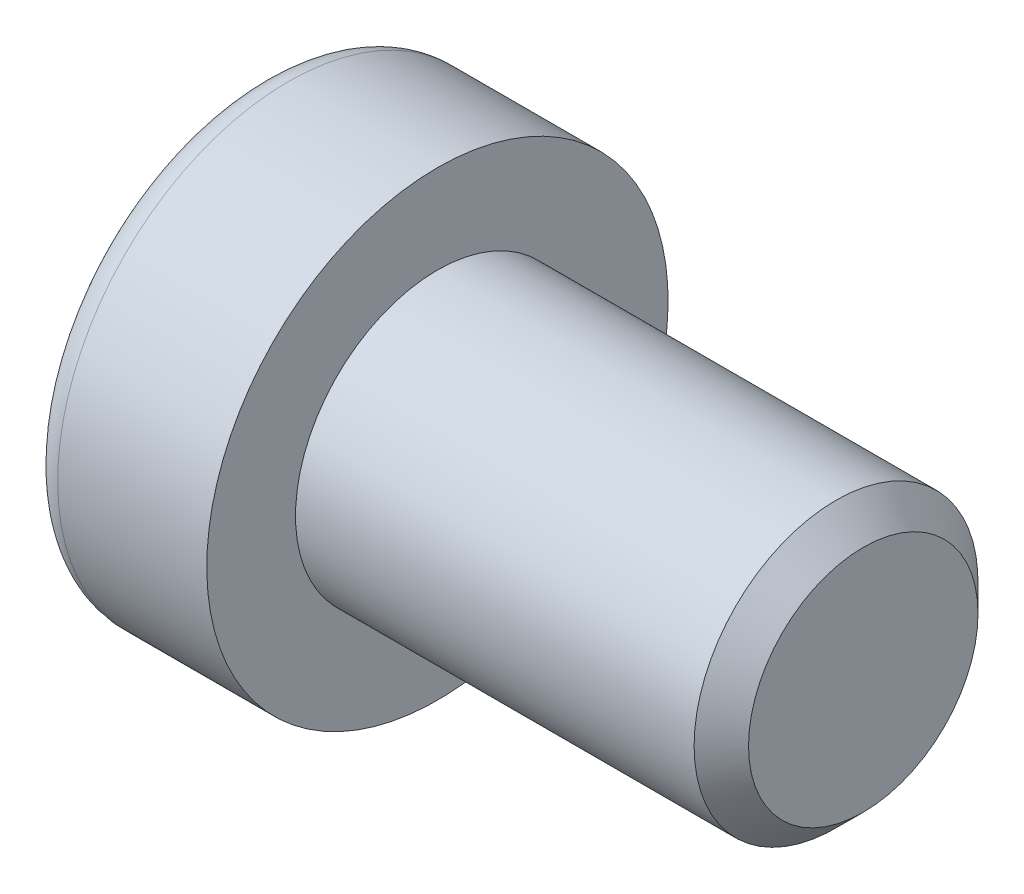
ISO-10303-21;
HEADER;
FILE_DESCRIPTION(('STEP AP214'),'2;1');
FILE_NAME('part.step','',(''),(''),'','','');
FILE_SCHEMA(('AUTOMOTIVE_DESIGN { 1 0 10303 214 1 1 1 1 }'));
ENDSEC;
DATA;
#1=APPLICATION_CONTEXT('core data for automotive mechanical design processes');
#2=APPLICATION_PROTOCOL_DEFINITION('international standard','automotive_design',2000,#1);
#3=PRODUCT_CONTEXT('',#1,'mechanical');
#4=PRODUCT('Part','Part','',(#3));
#5=PRODUCT_RELATED_PRODUCT_CATEGORY('part','',(#4));
#6=PRODUCT_DEFINITION_FORMATION('','',#4);
#7=PRODUCT_DEFINITION_CONTEXT('part definition',#1,'design');
#8=PRODUCT_DEFINITION('design','',#6,#7);
#9=PRODUCT_DEFINITION_SHAPE('','',#8);
#10=(LENGTH_UNIT() NAMED_UNIT(*) SI_UNIT(.MILLI.,.METRE.));
#11=(NAMED_UNIT(*) PLANE_ANGLE_UNIT() SI_UNIT($,.RADIAN.));
#12=(NAMED_UNIT(*) SI_UNIT($,.STERADIAN.) SOLID_ANGLE_UNIT());
#13=UNCERTAINTY_MEASURE_WITH_UNIT(LENGTH_MEASURE(1.E-05),#10,'distance_accuracy_value','');
#14=(GEOMETRIC_REPRESENTATION_CONTEXT(3) GLOBAL_UNCERTAINTY_ASSIGNED_CONTEXT((#13)) GLOBAL_UNIT_ASSIGNED_CONTEXT((#10,
#11,#12)) REPRESENTATION_CONTEXT('',''));
#15=CARTESIAN_POINT('',(0.,0.,0.));
#16=DIRECTION('',(0.,0.,1.));
#17=DIRECTION('',(1.,0.,0.));
#18=AXIS2_PLACEMENT_3D('',#15,#16,#17);
#19=CARTESIAN_POINT('',(-1.21000000177673,0.,0.));
#20=DIRECTION('',(-1.,0.,0.));
#21=DIRECTION('',(0.,0.,1.));
#22=AXIS2_PLACEMENT_3D('',#19,#20,#21);
#23=CONICAL_SURFACE('',#22,2.9040718530382,1.04719754996794);
#24=CARTESIAN_POINT('',(0.466666669012739,-1.13686837721616E-10,0.));
#25=VERTEX_POINT('',#24);
#26=VERTEX_LOOP('',#25);
#27=FACE_BOUND('',#26,.T.);
#28=CARTESIAN_POINT('',(-1.20000000188032,2.50000000042828,1.44337567243126));
#29=CARTESIAN_POINT('',(-1.16336943336427,2.50000000015382,1.31652043353318));
#30=CARTESIAN_POINT('',(-1.13005584831707,2.50000000004123,1.18857018203745));
#31=CARTESIAN_POINT('',(-1.07190798610144,2.49999999995868,0.930454306037677));
#32=CARTESIAN_POINT('',(-1.04709427719735,2.49999999998906,0.800284096806924));
#33=CARTESIAN_POINT('',(-1.00846995036617,2.50000000001067,0.541556812494233));
#34=CARTESIAN_POINT('',(-0.994402236162447,2.50000000000284,0.413039534770439));
#35=CARTESIAN_POINT('',(-0.977611461824864,2.49999999999716,0.155400578562858));
#36=CARTESIAN_POINT('',(-0.974874494142074,2.49999999999929,0.02627983588409));
#37=CARTESIAN_POINT('',(-0.980582864422355,2.50000000000062,-0.21496841995549));
#38=CARTESIAN_POINT('',(-0.987626608278002,2.50000000000017,-0.327132134383147));
#39=CARTESIAN_POINT('',(-1.00994662771906,2.49999999999983,-0.550728853222557));
#40=CARTESIAN_POINT('',(-1.02523052031715,2.49999999999995,-0.66216108485018));
#41=CARTESIAN_POINT('',(-1.06343729360609,2.50000000000005,-0.886218434015897));
#42=CARTESIAN_POINT('',(-1.08652205474861,2.50000000000003,-0.998815208377871));
#43=CARTESIAN_POINT('',(-1.13891470311393,2.49999999999998,-1.2223298619213));
#44=CARTESIAN_POINT('',(-1.16821028805135,2.49999999999995,-1.33325060237494));
#45=CARTESIAN_POINT('',(-1.20000000215881,2.5,-1.44337567242466));
#46=B_SPLINE_CURVE_WITH_KNOTS('',3,(#28,#29,#30,#31,#32,#33,#34,#35,#36,#37,#38,#39,#40,#41,#42,
#43,#44,#45),.UNSPECIFIED.,.F.,.F.,(4,2,2,2,2,2,2,2,4),(0.,0.396270014515872,0.793492271437725,
1.18088450788727,1.56780111135406,1.90463472821334,2.24178024186127,2.58640202744164,
2.93034746593166),.UNSPECIFIED.);
#47=CARTESIAN_POINT('',(-1.20000000213914,2.49999999973261,1.44337567281968));
#48=VERTEX_POINT('',#47);
#49=CARTESIAN_POINT('',(-1.20000000222827,2.5,-1.44337567266531));
#50=VERTEX_POINT('',#49);
#51=EDGE_CURVE('E18',#48,#50,#46,.T.);
#52=ORIENTED_EDGE('',*,*,#51,.T.);
#53=CARTESIAN_POINT('',(-1.20000000188032,2.49999999974406,-1.44337567361636));
#54=CARTESIAN_POINT('',(-1.16336943336427,2.39014014011794,-1.50680329282772));
#55=CARTESIAN_POINT('',(-1.13005584831707,2.27933197184574,-1.57077841847808));
#56=CARTESIAN_POINT('',(-1.07190798610144,2.05579706606859,-1.69983635640647));
#57=CARTESIAN_POINT('',(-1.04709427719735,1.94306635807401,-1.76492146104816));
#58=CARTESIAN_POINT('',(-1.00846995036617,1.71900195721787,-1.89428510322322));
#59=CARTESIAN_POINT('',(-0.994402236162447,1.60770272987993,-1.95854374207834));
#60=CARTESIAN_POINT('',(-0.977611461824864,1.38458084879682,-2.08736322017721));
#61=CARTESIAN_POINT('',(-0.974874494142074,1.27275900548255,-2.15192359151843));
#62=CARTESIAN_POINT('',(-0.980582864422354,1.06383188730746,-2.27254771943938));
#63=CARTESIAN_POINT('',(-0.987626608278001,0.966695261230055,-2.32862957665281));
#64=CARTESIAN_POINT('',(-1.00994662771905,0.773054822512112,-2.44042793607223));
#65=CARTESIAN_POINT('',(-1.02523052031715,0.676551679122258,-2.49614405188614));
#66=CARTESIAN_POINT('',(-1.06343729360609,0.482512322840196,-2.60817272646909));
#67=CARTESIAN_POINT('',(-1.08652205474861,0.385000655858529,-2.66447111365005));
#68=CARTESIAN_POINT('',(-1.13891470311393,0.191431287771819,-2.77622844042172));
#69=CARTESIAN_POINT('',(-1.16821028805135,0.09537110873237,-2.83168881064853));
#70=CARTESIAN_POINT('',(-1.20000000215881,4.75795596297873E-10,-2.88675134567343));
#71=B_SPLINE_CURVE_WITH_KNOTS('',3,(#53,#54,#55,#56,#57,#58,#59,#60,#61,#62,#63,#64,#65,#66,#67,
#68,#69,#70),.UNSPECIFIED.,.F.,.F.,(4,2,2,2,2,2,2,2,4),(0.,0.396270014515871,0.793492271437724,
1.18088450788727,1.56780111135406,1.90463472821334,2.24178024186127,2.58640202744164,
2.93034746593166),.UNSPECIFIED.);
#72=CARTESIAN_POINT('',(-1.20000000213914,0.,-2.88675134563937));
#73=VERTEX_POINT('',#72);
#74=EDGE_CURVE('E78',#50,#73,#71,.T.);
#75=ORIENTED_EDGE('',*,*,#74,.T.);
#76=CARTESIAN_POINT('',(-1.20000000188032,-6.84219601456786E-10,-2.88675134604762));
#77=CARTESIAN_POINT('',(-1.16336943336427,-0.109859860035873,-2.8233237263609));
#78=CARTESIAN_POINT('',(-1.13005584831707,-0.220668028195489,-2.75934860051552));
#79=CARTESIAN_POINT('',(-1.07190798610144,-0.444202933890087,-2.63029066244415));
#80=CARTESIAN_POINT('',(-1.04709427719735,-0.556933641915047,-2.56520555785509));
#81=CARTESIAN_POINT('',(-1.00846995036617,-0.780998042792801,-2.43584191571745));
#82=CARTESIAN_POINT('',(-0.994402236162447,-0.892297270122914,-2.37158327684878));
#83=CARTESIAN_POINT('',(-0.977611461824864,-1.11541915120034,-2.24276379874007));
#84=CARTESIAN_POINT('',(-0.974874494142074,-1.22724099451673,-2.17820342740253));
#85=CARTESIAN_POINT('',(-0.980582864422354,-1.43616811269316,-2.05757929948389));
#86=CARTESIAN_POINT('',(-0.987626608278001,-1.53330473877011,-2.00149744226967));
#87=CARTESIAN_POINT('',(-1.00994662771906,-1.72694517748772,-1.88969908284967));
#88=CARTESIAN_POINT('',(-1.02523052031715,-1.82344832087769,-1.83398296703597));
#89=CARTESIAN_POINT('',(-1.06343729360609,-2.01748767715985,-1.72195429245319));
#90=CARTESIAN_POINT('',(-1.08652205474861,-2.1149993441415,-1.66565590527218));
#91=CARTESIAN_POINT('',(-1.13891470311393,-2.30856871222816,-1.55389857850043));
#92=CARTESIAN_POINT('',(-1.16821028805135,-2.40462889126758,-1.49843820827358));
#93=CARTESIAN_POINT('',(-1.20000000215881,-2.49999999952421,-1.44337567324877));
#94=B_SPLINE_CURVE_WITH_KNOTS('',3,(#76,#77,#78,#79,#80,#81,#82,#83,#84,#85,#86,#87,#88,#89,#90,
#91,#92,#93),.UNSPECIFIED.,.F.,.F.,(4,2,2,2,2,2,2,2,4),(0.,0.396270014515872,0.793492271437725,
1.18088450788727,1.56780111135406,1.90463472821334,2.24178024186127,2.58640202744164,
2.93034746593167),.UNSPECIFIED.);
#95=CARTESIAN_POINT('',(-1.20000000213914,-2.49999999973261,-1.44337567281968));
#96=VERTEX_POINT('',#95);
#97=EDGE_CURVE('E103',#73,#96,#94,.T.);
#98=ORIENTED_EDGE('',*,*,#97,.T.);
#99=CARTESIAN_POINT('',(-1.20000000188032,-2.50000000042828,-1.44337567243126));
#100=CARTESIAN_POINT('',(-1.16336943336427,-2.50000000015382,-1.31652043353318));
#101=CARTESIAN_POINT('',(-1.13005584831707,-2.50000000004123,-1.18857018203745));
#102=CARTESIAN_POINT('',(-1.07190798610144,-2.49999999995868,-0.93045430603768));
#103=CARTESIAN_POINT('',(-1.04709427719735,-2.49999999998906,-0.800284096806928));
#104=CARTESIAN_POINT('',(-1.00846995036617,-2.50000000001067,-0.541556812494236));
#105=CARTESIAN_POINT('',(-0.994402236162447,-2.50000000000284,-0.413039534770443));
#106=CARTESIAN_POINT('',(-0.977611461824863,-2.49999999999716,-0.155400578562862));
#107=CARTESIAN_POINT('',(-0.974874494142073,-2.49999999999929,-0.0262798358840941));
#108=CARTESIAN_POINT('',(-0.980582864422354,-2.50000000000062,0.214968419955486));
#109=CARTESIAN_POINT('',(-0.987626608278001,-2.50000000000017,0.327132134383144));
#110=CARTESIAN_POINT('',(-1.00994662771905,-2.49999999999983,0.550728853222554));
#111=CARTESIAN_POINT('',(-1.02523052031715,-2.49999999999995,0.662161084850177));
#112=CARTESIAN_POINT('',(-1.06343729360609,-2.50000000000005,0.886218434015895));
#113=CARTESIAN_POINT('',(-1.08652205474861,-2.50000000000002,0.99881520837787));
#114=CARTESIAN_POINT('',(-1.13891470311393,-2.49999999999998,1.2223298619213));
#115=CARTESIAN_POINT('',(-1.16821028805135,-2.49999999999995,1.33325060237494));
#116=CARTESIAN_POINT('',(-1.20000000215881,-2.5,1.44337567242466));
#117=B_SPLINE_CURVE_WITH_KNOTS('',3,(#99,#100,#101,#102,#103,#104,#105,#106,#107,#108,#109,#110,
#111,#112,#113,#114,#115,#116),.UNSPECIFIED.,.F.,.F.,(4,2,2,2,2,2,2,2,4),(0.,0.396270014515872,
0.793492271437724,1.18088450788727,1.56780111135406,1.90463472821334,2.24178024186127,
2.58640202744164,2.93034746593167),.UNSPECIFIED.);
#118=CARTESIAN_POINT('',(-1.20000000213914,-2.49999999973261,1.44337567281969));
#119=VERTEX_POINT('',#118);
#120=EDGE_CURVE('E127',#96,#119,#117,.T.);
#121=ORIENTED_EDGE('',*,*,#120,.T.);
#122=CARTESIAN_POINT('',(-1.20000000188032,-2.49999999974406,1.44337567361636));
#123=CARTESIAN_POINT('',(-1.16336943336427,-2.39014014011795,1.50680329282772));
#124=CARTESIAN_POINT('',(-1.13005584831707,-2.27933197184574,1.57077841847807));
#125=CARTESIAN_POINT('',(-1.07190798610144,-2.05579706606859,1.69983635640647));
#126=CARTESIAN_POINT('',(-1.04709427719735,-1.94306635807401,1.76492146104816));
#127=CARTESIAN_POINT('',(-1.00846995036617,-1.71900195721787,1.89428510322322));
#128=CARTESIAN_POINT('',(-0.994402236162447,-1.60770272987993,1.95854374207834));
#129=CARTESIAN_POINT('',(-0.977611461824864,-1.38458084879682,2.08736322017721));
#130=CARTESIAN_POINT('',(-0.974874494142074,-1.27275900548255,2.15192359151843));
#131=CARTESIAN_POINT('',(-0.980582864422354,-1.06383188730746,2.27254771943938));
#132=CARTESIAN_POINT('',(-0.987626608278001,-0.966695261230056,2.32862957665281));
#133=CARTESIAN_POINT('',(-1.00994662771905,-0.773054822512113,2.44042793607223));
#134=CARTESIAN_POINT('',(-1.02523052031715,-0.676551679122259,2.49614405188614));
#135=CARTESIAN_POINT('',(-1.06343729360609,-0.482512322840196,2.60817272646909));
#136=CARTESIAN_POINT('',(-1.08652205474861,-0.385000655858529,2.66447111365005));
#137=CARTESIAN_POINT('',(-1.13891470311393,-0.19143128777182,2.77622844042172));
#138=CARTESIAN_POINT('',(-1.16821028805135,-0.0953711087323701,2.83168881064853));
#139=CARTESIAN_POINT('',(-1.20000000215881,-4.7579556411033E-10,2.88675134567343));
#140=B_SPLINE_CURVE_WITH_KNOTS('',3,(#122,#123,#124,#125,#126,#127,#128,#129,#130,#131,#132,
#133,#134,#135,#136,#137,#138,#139),.UNSPECIFIED.,.F.,.F.,(4,2,2,2,2,2,2,2,4),(0.,
0.396270014515872,0.793492271437724,1.18088450788727,1.56780111135406,1.90463472821334,
2.24178024186127,2.58640202744164,2.93034746593167),.UNSPECIFIED.);
#141=CARTESIAN_POINT('',(-1.20000000213914,0.,2.88675134563937));
#142=VERTEX_POINT('',#141);
#143=EDGE_CURVE('E135',#119,#142,#140,.T.);
#144=ORIENTED_EDGE('',*,*,#143,.T.);
#145=CARTESIAN_POINT('',(-1.20000000188032,6.84218410280577E-10,2.88675134604763));
#146=CARTESIAN_POINT('',(-1.16336943336427,0.109859860035872,2.8233237263609));
#147=CARTESIAN_POINT('',(-1.13005584831707,0.220668028195487,2.75934860051552));
#148=CARTESIAN_POINT('',(-1.07190798610144,0.444202933890086,2.63029066244415));
#149=CARTESIAN_POINT('',(-1.04709427719735,0.556933641915045,2.56520555785509));
#150=CARTESIAN_POINT('',(-1.00846995036617,0.780998042792799,2.43584191571745));
#151=CARTESIAN_POINT('',(-0.994402236162446,0.892297270122912,2.37158327684878));
#152=CARTESIAN_POINT('',(-0.977611461824863,1.11541915120034,2.24276379874007));
#153=CARTESIAN_POINT('',(-0.974874494142073,1.22724099451673,2.17820342740253));
#154=CARTESIAN_POINT('',(-0.980582864422353,1.43616811269316,2.05757929948389));
#155=CARTESIAN_POINT('',(-0.987626608278,1.53330473877011,2.00149744226967));
#156=CARTESIAN_POINT('',(-1.00994662771905,1.72694517748772,1.88969908284967));
#157=CARTESIAN_POINT('',(-1.02523052031715,1.82344832087769,1.83398296703596));
#158=CARTESIAN_POINT('',(-1.06343729360609,2.01748767715985,1.72195429245319));
#159=CARTESIAN_POINT('',(-1.08652205474861,2.1149993441415,1.66565590527218));
#160=CARTESIAN_POINT('',(-1.13891470311393,2.30856871222816,1.55389857850042));
#161=CARTESIAN_POINT('',(-1.16821028805135,2.40462889126758,1.49843820827358));
#162=CARTESIAN_POINT('',(-1.2000000021588,2.49999999952421,1.44337567324876));
#163=B_SPLINE_CURVE_WITH_KNOTS('',3,(#145,#146,#147,#148,#149,#150,#151,#152,#153,#154,#155,
#156,#157,#158,#159,#160,#161,#162),.UNSPECIFIED.,.F.,.F.,(4,2,2,2,2,2,2,2,4),(0.,
0.396270014515872,0.793492271437725,1.18088450788727,1.56780111135406,1.90463472821334,
2.24178024186127,2.58640202744164,2.93034746593167),.UNSPECIFIED.);
#164=EDGE_CURVE('E80',#142,#48,#163,.T.);
#165=ORIENTED_EDGE('',*,*,#164,.T.);
#166=EDGE_LOOP('',(#52,#75,#98,#121,#144,#165));
#167=FACE_BOUND('',#166,.T.);
#168=ADVANCED_FACE('F14',(#27,#167),#23,.F.);
#169=CARTESIAN_POINT('',(-5.,2.5,1.44337567297406));
#170=DIRECTION('',(0.,1.,0.));
#171=DIRECTION('',(0.,0.,1.));
#172=AXIS2_PLACEMENT_3D('',#169,#170,#171);
#173=PLANE('',#172);
#174=DIRECTION('',(1.,0.,0.));
#175=VECTOR('',#174,1.);
#176=CARTESIAN_POINT('',(-5.,2.5,1.44337567297406));
#177=LINE('',#176,#175);
#178=CARTESIAN_POINT('',(-5.,2.5,1.44337567297406));
#179=VERTEX_POINT('',#178);
#180=EDGE_CURVE('E82',#48,#179,#177,.F.);
#181=ORIENTED_EDGE('',*,*,#180,.T.);
#182=DIRECTION('',(0.,0.,1.));
#183=VECTOR('',#182,1.);
#184=CARTESIAN_POINT('',(-5.,2.5,0.));
#185=LINE('',#184,#183);
#186=CARTESIAN_POINT('',(-5.,2.5,-1.44337567297407));
#187=VERTEX_POINT('',#186);
#188=EDGE_CURVE('E87',#187,#179,#185,.T.);
#189=ORIENTED_EDGE('',*,*,#188,.F.);
#190=DIRECTION('',(1.,0.,0.));
#191=VECTOR('',#190,1.);
#192=CARTESIAN_POINT('',(-5.,2.5,-1.44337567297407));
#193=LINE('',#192,#191);
#194=EDGE_CURVE('E85',#187,#50,#193,.T.);
#195=ORIENTED_EDGE('',*,*,#194,.T.);
#196=ORIENTED_EDGE('',*,*,#51,.F.);
#197=EDGE_LOOP('',(#181,#189,#195,#196));
#198=FACE_BOUND('',#197,.T.);
#199=ADVANCED_FACE('F74',(#198),#173,.F.);
#200=CARTESIAN_POINT('',(-5.,0.,2.88675134594813));
#201=DIRECTION('',(0.,0.500000000000001,0.866025403784438));
#202=DIRECTION('',(0.,-0.866025403784438,0.500000000000001));
#203=AXIS2_PLACEMENT_3D('',#200,#201,#202);
#204=PLANE('',#203);
#205=DIRECTION('',(1.,0.,0.));
#206=VECTOR('',#205,1.);
#207=CARTESIAN_POINT('',(-5.,0.,2.88675134594813));
#208=LINE('',#207,#206);
#209=CARTESIAN_POINT('',(-5.,0.,2.88675134594813));
#210=VERTEX_POINT('',#209);
#211=EDGE_CURVE('E139',#142,#210,#208,.F.);
#212=ORIENTED_EDGE('',*,*,#211,.T.);
#213=DIRECTION('',(0.,-0.866025403784438,0.500000000000001));
#214=VECTOR('',#213,1.);
#215=CARTESIAN_POINT('',(-5.,2.5,1.44337567297406));
#216=LINE('',#215,#214);
#217=EDGE_CURVE('E93',#179,#210,#216,.T.);
#218=ORIENTED_EDGE('',*,*,#217,.F.);
#219=ORIENTED_EDGE('',*,*,#180,.F.);
#220=ORIENTED_EDGE('',*,*,#164,.F.);
#221=EDGE_LOOP('',(#212,#218,#219,#220));
#222=FACE_BOUND('',#221,.T.);
#223=ADVANCED_FACE('F143',(#222),#204,.F.);
#224=CARTESIAN_POINT('',(-5.,-2.5,1.44337567297406));
#225=DIRECTION('',(0.,-0.5,0.866025403784439));
#226=DIRECTION('',(0.,-0.866025403784439,-0.5));
#227=AXIS2_PLACEMENT_3D('',#224,#225,#226);
#228=PLANE('',#227);
#229=DIRECTION('',(1.,0.,0.));
#230=VECTOR('',#229,1.);
#231=CARTESIAN_POINT('',(-5.,-2.5,1.44337567297406));
#232=LINE('',#231,#230);
#233=CARTESIAN_POINT('',(-5.,-2.5,1.44337567297406));
#234=VERTEX_POINT('',#233);
#235=EDGE_CURVE('E134',#119,#234,#232,.F.);
#236=ORIENTED_EDGE('',*,*,#235,.T.);
#237=DIRECTION('',(0.,-0.866025403784439,-0.5));
#238=VECTOR('',#237,1.);
#239=CARTESIAN_POINT('',(-5.,0.,2.88675134594813));
#240=LINE('',#239,#238);
#241=EDGE_CURVE('E222',#210,#234,#240,.T.);
#242=ORIENTED_EDGE('',*,*,#241,.F.);
#243=ORIENTED_EDGE('',*,*,#211,.F.);
#244=ORIENTED_EDGE('',*,*,#143,.F.);
#245=EDGE_LOOP('',(#236,#242,#243,#244));
#246=FACE_BOUND('',#245,.T.);
#247=ADVANCED_FACE('F123',(#246),#228,.F.);
#248=CARTESIAN_POINT('',(-5.,-2.5,-1.44337567297406));
#249=DIRECTION('',(0.,-1.,0.));
#250=DIRECTION('',(0.,0.,-1.));
#251=AXIS2_PLACEMENT_3D('',#248,#249,#250);
#252=PLANE('',#251);
#253=DIRECTION('',(1.,0.,0.));
#254=VECTOR('',#253,1.);
#255=CARTESIAN_POINT('',(-5.,-2.5,-1.44337567297406));
#256=LINE('',#255,#254);
#257=CARTESIAN_POINT('',(-5.,-2.5,-1.44337567297406));
#258=VERTEX_POINT('',#257);
#259=EDGE_CURVE('E133',#96,#258,#256,.F.);
#260=ORIENTED_EDGE('',*,*,#259,.T.);
#261=DIRECTION('',(0.,0.,1.));
#262=VECTOR('',#261,1.);
#263=CARTESIAN_POINT('',(-5.,-2.5,0.));
#264=LINE('',#263,#262);
#265=EDGE_CURVE('E219',#234,#258,#264,.F.);
#266=ORIENTED_EDGE('',*,*,#265,.F.);
#267=ORIENTED_EDGE('',*,*,#235,.F.);
#268=ORIENTED_EDGE('',*,*,#120,.F.);
#269=EDGE_LOOP('',(#260,#266,#267,#268));
#270=FACE_BOUND('',#269,.T.);
#271=ADVANCED_FACE('F119',(#270),#252,.F.);
#272=CARTESIAN_POINT('',(-5.,0.,-2.88675134594813));
#273=DIRECTION('',(0.,-0.5,-0.866025403784439));
#274=DIRECTION('',(0.,0.866025403784439,-0.5));
#275=AXIS2_PLACEMENT_3D('',#272,#273,#274);
#276=PLANE('',#275);
#277=DIRECTION('',(1.,0.,0.));
#278=VECTOR('',#277,1.);
#279=CARTESIAN_POINT('',(-5.,0.,-2.88675134594813));
#280=LINE('',#279,#278);
#281=CARTESIAN_POINT('',(-5.,0.,-2.88675134594813));
#282=VERTEX_POINT('',#281);
#283=EDGE_CURVE('E36',#73,#282,#280,.F.);
#284=ORIENTED_EDGE('',*,*,#283,.T.);
#285=DIRECTION('',(0.,0.866025403784438,-0.500000000000001));
#286=VECTOR('',#285,1.);
#287=CARTESIAN_POINT('',(-5.,-2.5,-1.44337567297406));
#288=LINE('',#287,#286);
#289=EDGE_CURVE('E216',#258,#282,#288,.T.);
#290=ORIENTED_EDGE('',*,*,#289,.F.);
#291=ORIENTED_EDGE('',*,*,#259,.F.);
#292=ORIENTED_EDGE('',*,*,#97,.F.);
#293=EDGE_LOOP('',(#284,#290,#291,#292));
#294=FACE_BOUND('',#293,.T.);
#295=ADVANCED_FACE('F113',(#294),#276,.F.);
#296=CARTESIAN_POINT('',(-5.,2.5,-1.44337567297407));
#297=DIRECTION('',(0.,0.5,-0.866025403784439));
#298=DIRECTION('',(0.,0.866025403784439,0.5));
#299=AXIS2_PLACEMENT_3D('',#296,#297,#298);
#300=PLANE('',#299);
#301=ORIENTED_EDGE('',*,*,#194,.F.);
#302=DIRECTION('',(0.,0.866025403784439,0.5));
#303=VECTOR('',#302,1.);
#304=CARTESIAN_POINT('',(-5.,0.,-2.88675134594813));
#305=LINE('',#304,#303);
#306=EDGE_CURVE('E214',#282,#187,#305,.T.);
#307=ORIENTED_EDGE('',*,*,#306,.F.);
#308=ORIENTED_EDGE('',*,*,#283,.F.);
#309=ORIENTED_EDGE('',*,*,#74,.F.);
#310=EDGE_LOOP('',(#301,#307,#308,#309));
#311=FACE_BOUND('',#310,.T.);
#312=ADVANCED_FACE('F91',(#311),#300,.F.);
#313=CARTESIAN_POINT('',(-5.,4.69337567297407,0.));
#314=DIRECTION('',(-1.,0.,0.));
#315=DIRECTION('',(0.,0.,1.));
#316=AXIS2_PLACEMENT_3D('',#313,#314,#315);
#317=PLANE('',#316);
#318=ORIENTED_EDGE('',*,*,#289,.T.);
#319=ORIENTED_EDGE('',*,*,#306,.T.);
#320=ORIENTED_EDGE('',*,*,#188,.T.);
#321=ORIENTED_EDGE('',*,*,#217,.T.);
#322=ORIENTED_EDGE('',*,*,#241,.T.);
#323=ORIENTED_EDGE('',*,*,#265,.T.);
#324=EDGE_LOOP('',(#318,#319,#320,#321,#322,#323));
#325=FACE_BOUND('',#324,.T.);
#326=CARTESIAN_POINT('',(-5.,0.,0.));
#327=DIRECTION('',(1.,0.,0.));
#328=DIRECTION('',(0.,1.,0.));
#329=AXIS2_PLACEMENT_3D('',#326,#327,#328);
#330=CIRCLE('',#329,5.7);
#331=CARTESIAN_POINT('',(-5.,5.7,0.));
#332=VERTEX_POINT('',#331);
#333=EDGE_CURVE('E191',#332,#332,#330,.T.);
#334=ORIENTED_EDGE('',*,*,#333,.F.);
#335=EDGE_LOOP('',(#334));
#336=FACE_BOUND('',#335,.T.);
#337=ADVANCED_FACE('F112',(#325,#336),#317,.T.);
#338=CARTESIAN_POINT('',(-4.2,0.,0.));
#339=DIRECTION('',(1.,0.,0.));
#340=DIRECTION('',(0.,0.,-1.));
#341=AXIS2_PLACEMENT_3D('',#338,#339,#340);
#342=TOROIDAL_SURFACE('',#341,5.7,0.8);
#343=CARTESIAN_POINT('',(-4.2,0.,0.));
#344=DIRECTION('',(1.,0.,0.));
#345=DIRECTION('',(0.,1.,0.));
#346=AXIS2_PLACEMENT_3D('',#343,#344,#345);
#347=CIRCLE('',#346,6.5);
#348=CARTESIAN_POINT('',(-4.2,6.5,0.));
#349=VERTEX_POINT('',#348);
#350=EDGE_CURVE('E232',#349,#349,#347,.T.);
#351=ORIENTED_EDGE('',*,*,#350,.F.);
#352=EDGE_LOOP('',(#351));
#353=FACE_BOUND('',#352,.T.);
#354=ORIENTED_EDGE('',*,*,#333,.T.);
#355=EDGE_LOOP('',(#354));
#356=FACE_BOUND('',#355,.T.);
#357=ADVANCED_FACE('F175',(#353,#356),#342,.T.);
#358=CARTESIAN_POINT('',(-2.5,0.,0.));
#359=DIRECTION('',(1.,0.,0.));
#360=DIRECTION('',(0.,1.,0.));
#361=AXIS2_PLACEMENT_3D('',#358,#359,#360);
#362=CYLINDRICAL_SURFACE('',#361,6.5);
#363=ORIENTED_EDGE('',*,*,#350,.T.);
#364=EDGE_LOOP('',(#363));
#365=FACE_BOUND('',#364,.T.);
#366=CARTESIAN_POINT('',(0.,0.,0.));
#367=DIRECTION('',(1.,0.,0.));
#368=DIRECTION('',(0.,1.,0.));
#369=AXIS2_PLACEMENT_3D('',#366,#367,#368);
#370=CIRCLE('',#369,6.5);
#371=CARTESIAN_POINT('',(0.,6.5,0.));
#372=VERTEX_POINT('',#371);
#373=EDGE_CURVE('E101',#372,#372,#370,.T.);
#374=ORIENTED_EDGE('',*,*,#373,.F.);
#375=EDGE_LOOP('',(#374));
#376=FACE_BOUND('',#375,.T.);
#377=ADVANCED_FACE('F172',(#365,#376),#362,.T.);
#378=CARTESIAN_POINT('',(12.,2.,0.));
#379=DIRECTION('',(1.,0.,0.));
#380=DIRECTION('',(0.,0.,-1.));
#381=AXIS2_PLACEMENT_3D('',#378,#379,#380);
#382=PLANE('',#381);
#383=CARTESIAN_POINT('',(12.0000000003984,0.,0.));
#384=DIRECTION('',(-1.,0.,0.));
#385=DIRECTION('',(0.,0.,1.));
#386=AXIS2_PLACEMENT_3D('',#383,#384,#385);
#387=CIRCLE('',#386,3.23318750031376);
#388=CARTESIAN_POINT('',(12.0000000003984,0.,3.23318750031376));
#389=VERTEX_POINT('',#388);
#390=EDGE_CURVE('E228',#389,#389,#387,.T.);
#391=ORIENTED_EDGE('',*,*,#390,.F.);
#392=EDGE_LOOP('',(#391));
#393=FACE_BOUND('',#392,.T.);
#394=ADVANCED_FACE('F168',(#393),#382,.T.);
#395=CARTESIAN_POINT('',(0.,5.25,0.));
#396=DIRECTION('',(1.,0.,0.));
#397=DIRECTION('',(0.,0.,-1.));
#398=AXIS2_PLACEMENT_3D('',#395,#396,#397);
#399=PLANE('',#398);
#400=CARTESIAN_POINT('',(0.,0.,0.));
#401=DIRECTION('',(1.,0.,0.));
#402=DIRECTION('',(0.,1.,0.));
#403=AXIS2_PLACEMENT_3D('',#400,#401,#402);
#404=CIRCLE('',#403,4.);
#405=CARTESIAN_POINT('',(0.,4.,0.));
#406=VERTEX_POINT('',#405);
#407=EDGE_CURVE('E27',#406,#406,#404,.T.);
#408=ORIENTED_EDGE('',*,*,#407,.F.);
#409=EDGE_LOOP('',(#408));
#410=FACE_BOUND('',#409,.T.);
#411=ORIENTED_EDGE('',*,*,#373,.T.);
#412=EDGE_LOOP('',(#411));
#413=FACE_BOUND('',#412,.T.);
#414=ADVANCED_FACE('F161',(#410,#413),#399,.T.);
#415=CARTESIAN_POINT('',(11.233187499613,0.,0.));
#416=DIRECTION('',(-1.,0.,0.));
#417=DIRECTION('',(0.,0.,1.));
#418=AXIS2_PLACEMENT_3D('',#415,#416,#417);
#419=CONICAL_SURFACE('',#418,3.99999999967804,0.78539816247083);
#420=ORIENTED_EDGE('',*,*,#390,.T.);
#421=EDGE_LOOP('',(#420));
#422=FACE_BOUND('',#421,.T.);
#423=CARTESIAN_POINT('',(11.2331875,0.,0.));
#424=DIRECTION('',(1.,0.,0.));
#425=DIRECTION('',(0.,1.,0.));
#426=AXIS2_PLACEMENT_3D('',#423,#424,#425);
#427=CIRCLE('',#426,4.);
#428=CARTESIAN_POINT('',(11.2331875,4.,0.));
#429=VERTEX_POINT('',#428);
#430=EDGE_CURVE('E9',#429,#429,#427,.F.);
#431=ORIENTED_EDGE('',*,*,#430,.F.);
#432=EDGE_LOOP('',(#431));
#433=FACE_BOUND('',#432,.T.);
#434=ADVANCED_FACE('F154',(#422,#433),#419,.T.);
#435=CARTESIAN_POINT('',(6.5,0.,0.));
#436=DIRECTION('',(1.,0.,0.));
#437=DIRECTION('',(0.,1.,0.));
#438=AXIS2_PLACEMENT_3D('',#435,#436,#437);
#439=CYLINDRICAL_SURFACE('',#438,4.);
#440=ORIENTED_EDGE('',*,*,#430,.T.);
#441=EDGE_LOOP('',(#440));
#442=FACE_BOUND('',#441,.T.);
#443=ORIENTED_EDGE('',*,*,#407,.T.);
#444=EDGE_LOOP('',(#443));
#445=FACE_BOUND('',#444,.T.);
#446=ADVANCED_FACE('F152',(#442,#445),#439,.T.);
#447=CLOSED_SHELL('',(#168,#199,#223,#247,#271,#295,#312,#337,#357,#377,#394,#414,#434,#446));
#448=MANIFOLD_SOLID_BREP('B1',#447);
#449=ADVANCED_BREP_SHAPE_REPRESENTATION('',(#18,#448),#14);
#450=SHAPE_DEFINITION_REPRESENTATION(#9,#449);
ENDSEC;
END-ISO-10303-21;
